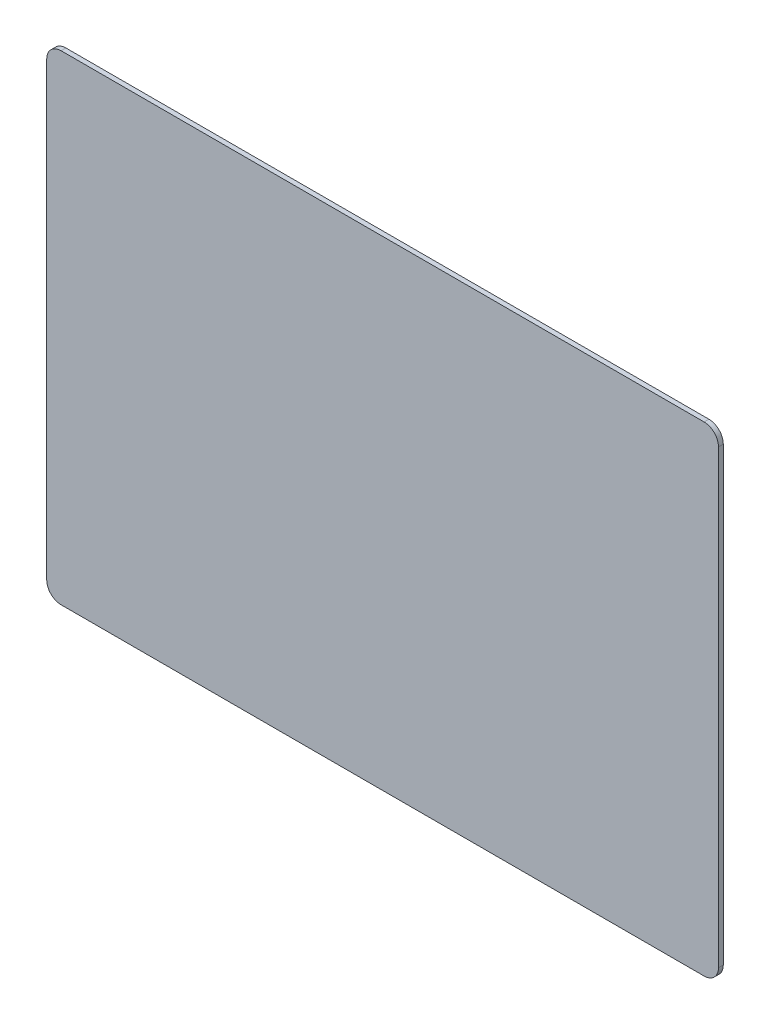
ISO-10303-21;
HEADER;
FILE_DESCRIPTION(('STEP AP214'),'2;1');
FILE_NAME('part.step','',(''),(''),'','','');
FILE_SCHEMA(('AUTOMOTIVE_DESIGN { 1 0 10303 214 1 1 1 1 }'));
ENDSEC;
DATA;
#1=APPLICATION_CONTEXT('core data for automotive mechanical design processes');
#2=APPLICATION_PROTOCOL_DEFINITION('international standard','automotive_design',2000,#1);
#3=PRODUCT_CONTEXT('',#1,'mechanical');
#4=PRODUCT('Part','Part','',(#3));
#5=PRODUCT_RELATED_PRODUCT_CATEGORY('part','',(#4));
#6=PRODUCT_DEFINITION_FORMATION('','',#4);
#7=PRODUCT_DEFINITION_CONTEXT('part definition',#1,'design');
#8=PRODUCT_DEFINITION('design','',#6,#7);
#9=PRODUCT_DEFINITION_SHAPE('','',#8);
#10=(LENGTH_UNIT() NAMED_UNIT(*) SI_UNIT(.MILLI.,.METRE.));
#11=(NAMED_UNIT(*) PLANE_ANGLE_UNIT() SI_UNIT($,.RADIAN.));
#12=(NAMED_UNIT(*) SI_UNIT($,.STERADIAN.) SOLID_ANGLE_UNIT());
#13=UNCERTAINTY_MEASURE_WITH_UNIT(LENGTH_MEASURE(1.E-05),#10,'distance_accuracy_value','');
#14=(GEOMETRIC_REPRESENTATION_CONTEXT(3) GLOBAL_UNCERTAINTY_ASSIGNED_CONTEXT((#13)) GLOBAL_UNIT_ASSIGNED_CONTEXT((#10,
#11,#12)) REPRESENTATION_CONTEXT('',''));
#15=CARTESIAN_POINT('',(0.,0.,0.));
#16=DIRECTION('',(0.,0.,1.));
#17=DIRECTION('',(1.,0.,0.));
#18=AXIS2_PLACEMENT_3D('',#15,#16,#17);
#19=CARTESIAN_POINT('',(70.,-50.,-1.));
#20=DIRECTION('',(1.,0.,0.));
#21=DIRECTION('',(0.,0.,-1.));
#22=AXIS2_PLACEMENT_3D('',#19,#20,#21);
#23=PLANE('',#22);
#24=DIRECTION('',(0.,1.,0.));
#25=VECTOR('',#24,1.);
#26=CARTESIAN_POINT('',(70.,-50.,0.));
#27=LINE('',#26,#25);
#28=CARTESIAN_POINT('',(70.,-47.,0.));
#29=VERTEX_POINT('',#28);
#30=CARTESIAN_POINT('',(70.,47.,0.));
#31=VERTEX_POINT('',#30);
#32=EDGE_CURVE('E106',#29,#31,#27,.T.);
#33=ORIENTED_EDGE('',*,*,#32,.F.);
#34=DIRECTION('',(0.,0.,1.));
#35=VECTOR('',#34,1.);
#36=CARTESIAN_POINT('',(70.,-47.,-1.));
#37=LINE('',#36,#35);
#38=CARTESIAN_POINT('',(70.,-47.,-1.));
#39=VERTEX_POINT('',#38);
#40=EDGE_CURVE('E11',#29,#39,#37,.F.);
#41=ORIENTED_EDGE('',*,*,#40,.T.);
#42=DIRECTION('',(0.,1.,0.));
#43=VECTOR('',#42,1.);
#44=CARTESIAN_POINT('',(70.,-50.,-1.));
#45=LINE('',#44,#43);
#46=CARTESIAN_POINT('',(70.,47.,-1.));
#47=VERTEX_POINT('',#46);
#48=EDGE_CURVE('E156',#39,#47,#45,.T.);
#49=ORIENTED_EDGE('',*,*,#48,.T.);
#50=DIRECTION('',(0.,0.,1.));
#51=VECTOR('',#50,1.);
#52=CARTESIAN_POINT('',(70.,47.,-1.));
#53=LINE('',#52,#51);
#54=EDGE_CURVE('E43',#47,#31,#53,.T.);
#55=ORIENTED_EDGE('',*,*,#54,.T.);
#56=EDGE_LOOP('',(#33,#41,#49,#55));
#57=FACE_BOUND('',#56,.T.);
#58=ADVANCED_FACE('F35',(#57),#23,.T.);
#59=CARTESIAN_POINT('',(-70.,-50.,-1.));
#60=DIRECTION('',(0.,-1.,0.));
#61=DIRECTION('',(0.,0.,-1.));
#62=AXIS2_PLACEMENT_3D('',#59,#60,#61);
#63=PLANE('',#62);
#64=DIRECTION('',(1.,0.,0.));
#65=VECTOR('',#64,1.);
#66=CARTESIAN_POINT('',(-70.,-50.,0.));
#67=LINE('',#66,#65);
#68=CARTESIAN_POINT('',(-67.,-50.,0.));
#69=VERTEX_POINT('',#68);
#70=CARTESIAN_POINT('',(67.,-50.,0.));
#71=VERTEX_POINT('',#70);
#72=EDGE_CURVE('E131',#69,#71,#67,.T.);
#73=ORIENTED_EDGE('',*,*,#72,.F.);
#74=DIRECTION('',(0.,0.,1.));
#75=VECTOR('',#74,1.);
#76=CARTESIAN_POINT('',(-67.,-50.,-1.));
#77=LINE('',#76,#75);
#78=CARTESIAN_POINT('',(-67.,-50.,-1.));
#79=VERTEX_POINT('',#78);
#80=EDGE_CURVE('E57',#69,#79,#77,.F.);
#81=ORIENTED_EDGE('',*,*,#80,.T.);
#82=DIRECTION('',(1.,0.,0.));
#83=VECTOR('',#82,1.);
#84=CARTESIAN_POINT('',(-70.,-50.,-1.));
#85=LINE('',#84,#83);
#86=CARTESIAN_POINT('',(67.,-50.,-1.));
#87=VERTEX_POINT('',#86);
#88=EDGE_CURVE('E125',#79,#87,#85,.T.);
#89=ORIENTED_EDGE('',*,*,#88,.T.);
#90=DIRECTION('',(0.,0.,1.));
#91=VECTOR('',#90,1.);
#92=CARTESIAN_POINT('',(67.,-50.,-1.));
#93=LINE('',#92,#91);
#94=EDGE_CURVE('E150',#87,#71,#93,.T.);
#95=ORIENTED_EDGE('',*,*,#94,.T.);
#96=EDGE_LOOP('',(#73,#81,#89,#95));
#97=FACE_BOUND('',#96,.T.);
#98=ADVANCED_FACE('F188',(#97),#63,.T.);
#99=CARTESIAN_POINT('',(-70.,-50.,-1.));
#100=DIRECTION('',(-1.,0.,0.));
#101=DIRECTION('',(0.,0.,1.));
#102=AXIS2_PLACEMENT_3D('',#99,#100,#101);
#103=PLANE('',#102);
#104=DIRECTION('',(0.,-1.,0.));
#105=VECTOR('',#104,1.);
#106=CARTESIAN_POINT('',(-70.,-50.,0.));
#107=LINE('',#106,#105);
#108=CARTESIAN_POINT('',(-70.,47.,0.));
#109=VERTEX_POINT('',#108);
#110=CARTESIAN_POINT('',(-70.,-47.,0.));
#111=VERTEX_POINT('',#110);
#112=EDGE_CURVE('E121',#109,#111,#107,.T.);
#113=ORIENTED_EDGE('',*,*,#112,.F.);
#114=DIRECTION('',(0.,0.,1.));
#115=VECTOR('',#114,1.);
#116=CARTESIAN_POINT('',(-70.,47.,-1.));
#117=LINE('',#116,#115);
#118=CARTESIAN_POINT('',(-70.,47.,-1.));
#119=VERTEX_POINT('',#118);
#120=EDGE_CURVE('E142',#109,#119,#117,.F.);
#121=ORIENTED_EDGE('',*,*,#120,.T.);
#122=DIRECTION('',(0.,-1.,0.));
#123=VECTOR('',#122,1.);
#124=CARTESIAN_POINT('',(-70.,-50.,-1.));
#125=LINE('',#124,#123);
#126=CARTESIAN_POINT('',(-70.,-47.,-1.));
#127=VERTEX_POINT('',#126);
#128=EDGE_CURVE('E128',#119,#127,#125,.T.);
#129=ORIENTED_EDGE('',*,*,#128,.T.);
#130=DIRECTION('',(0.,0.,1.));
#131=VECTOR('',#130,1.);
#132=CARTESIAN_POINT('',(-70.,-47.,-1.));
#133=LINE('',#132,#131);
#134=EDGE_CURVE('E139',#127,#111,#133,.T.);
#135=ORIENTED_EDGE('',*,*,#134,.T.);
#136=EDGE_LOOP('',(#113,#121,#129,#135));
#137=FACE_BOUND('',#136,.T.);
#138=ADVANCED_FACE('F168',(#137),#103,.T.);
#139=CARTESIAN_POINT('',(-70.,50.,-1.));
#140=DIRECTION('',(0.,1.,0.));
#141=DIRECTION('',(0.,0.,1.));
#142=AXIS2_PLACEMENT_3D('',#139,#140,#141);
#143=PLANE('',#142);
#144=DIRECTION('',(-1.,0.,0.));
#145=VECTOR('',#144,1.);
#146=CARTESIAN_POINT('',(-70.,50.,-1.));
#147=LINE('',#146,#145);
#148=CARTESIAN_POINT('',(67.,50.,-1.));
#149=VERTEX_POINT('',#148);
#150=CARTESIAN_POINT('',(-67.,50.,-1.));
#151=VERTEX_POINT('',#150);
#152=EDGE_CURVE('E157',#149,#151,#147,.T.);
#153=ORIENTED_EDGE('',*,*,#152,.T.);
#154=DIRECTION('',(0.,0.,1.));
#155=VECTOR('',#154,1.);
#156=CARTESIAN_POINT('',(-67.,50.,-1.));
#157=LINE('',#156,#155);
#158=CARTESIAN_POINT('',(-67.,50.,0.));
#159=VERTEX_POINT('',#158);
#160=EDGE_CURVE('E112',#151,#159,#157,.T.);
#161=ORIENTED_EDGE('',*,*,#160,.T.);
#162=DIRECTION('',(-1.,0.,0.));
#163=VECTOR('',#162,1.);
#164=CARTESIAN_POINT('',(-70.,50.,0.));
#165=LINE('',#164,#163);
#166=CARTESIAN_POINT('',(67.,50.,0.));
#167=VERTEX_POINT('',#166);
#168=EDGE_CURVE('E104',#167,#159,#165,.T.);
#169=ORIENTED_EDGE('',*,*,#168,.F.);
#170=DIRECTION('',(0.,0.,1.));
#171=VECTOR('',#170,1.);
#172=CARTESIAN_POINT('',(67.,50.,-1.));
#173=LINE('',#172,#171);
#174=EDGE_CURVE('E118',#167,#149,#173,.F.);
#175=ORIENTED_EDGE('',*,*,#174,.T.);
#176=EDGE_LOOP('',(#153,#161,#169,#175));
#177=FACE_BOUND('',#176,.T.);
#178=ADVANCED_FACE('F117',(#177),#143,.T.);
#179=CARTESIAN_POINT('',(0.,0.,-1.));
#180=DIRECTION('',(0.,0.,-1.));
#181=DIRECTION('',(-1.,0.,0.));
#182=AXIS2_PLACEMENT_3D('',#179,#180,#181);
#183=PLANE('',#182);
#184=ORIENTED_EDGE('',*,*,#128,.F.);
#185=CARTESIAN_POINT('',(-67.,47.,-1.));
#186=DIRECTION('',(0.,0.,-1.));
#187=DIRECTION('',(-1.,0.,0.));
#188=AXIS2_PLACEMENT_3D('',#185,#186,#187);
#189=CIRCLE('',#188,3.);
#190=EDGE_CURVE('E148',#119,#151,#189,.T.);
#191=ORIENTED_EDGE('',*,*,#190,.T.);
#192=ORIENTED_EDGE('',*,*,#152,.F.);
#193=CARTESIAN_POINT('',(67.,47.,-1.));
#194=DIRECTION('',(0.,0.,-1.));
#195=DIRECTION('',(-1.,0.,0.));
#196=AXIS2_PLACEMENT_3D('',#193,#194,#195);
#197=CIRCLE('',#196,3.);
#198=EDGE_CURVE('E124',#149,#47,#197,.T.);
#199=ORIENTED_EDGE('',*,*,#198,.T.);
#200=ORIENTED_EDGE('',*,*,#48,.F.);
#201=CARTESIAN_POINT('',(67.,-47.,-1.));
#202=DIRECTION('',(0.,0.,-1.));
#203=DIRECTION('',(-1.,0.,0.));
#204=AXIS2_PLACEMENT_3D('',#201,#202,#203);
#205=CIRCLE('',#204,3.);
#206=EDGE_CURVE('E50',#39,#87,#205,.T.);
#207=ORIENTED_EDGE('',*,*,#206,.T.);
#208=ORIENTED_EDGE('',*,*,#88,.F.);
#209=CARTESIAN_POINT('',(-67.,-47.,-1.));
#210=DIRECTION('',(0.,0.,-1.));
#211=DIRECTION('',(-1.,0.,0.));
#212=AXIS2_PLACEMENT_3D('',#209,#210,#211);
#213=CIRCLE('',#212,3.);
#214=EDGE_CURVE('E146',#79,#127,#213,.T.);
#215=ORIENTED_EDGE('',*,*,#214,.T.);
#216=EDGE_LOOP('',(#184,#191,#192,#199,#200,#207,#208,#215));
#217=FACE_BOUND('',#216,.T.);
#218=ADVANCED_FACE('F174',(#217),#183,.T.);
#219=CARTESIAN_POINT('',(0.,0.,0.));
#220=DIRECTION('',(0.,0.,-1.));
#221=DIRECTION('',(-1.,0.,0.));
#222=AXIS2_PLACEMENT_3D('',#219,#220,#221);
#223=PLANE('',#222);
#224=ORIENTED_EDGE('',*,*,#168,.T.);
#225=CARTESIAN_POINT('',(-67.,47.,0.));
#226=DIRECTION('',(0.,0.,-1.));
#227=DIRECTION('',(-1.,0.,0.));
#228=AXIS2_PLACEMENT_3D('',#225,#226,#227);
#229=CIRCLE('',#228,3.);
#230=EDGE_CURVE('E137',#159,#109,#229,.F.);
#231=ORIENTED_EDGE('',*,*,#230,.T.);
#232=ORIENTED_EDGE('',*,*,#112,.T.);
#233=CARTESIAN_POINT('',(-67.,-47.,0.));
#234=DIRECTION('',(0.,0.,-1.));
#235=DIRECTION('',(-1.,0.,0.));
#236=AXIS2_PLACEMENT_3D('',#233,#234,#235);
#237=CIRCLE('',#236,3.);
#238=EDGE_CURVE('E135',#111,#69,#237,.F.);
#239=ORIENTED_EDGE('',*,*,#238,.T.);
#240=ORIENTED_EDGE('',*,*,#72,.T.);
#241=CARTESIAN_POINT('',(67.,-47.,0.));
#242=DIRECTION('',(0.,0.,-1.));
#243=DIRECTION('',(-1.,0.,0.));
#244=AXIS2_PLACEMENT_3D('',#241,#242,#243);
#245=CIRCLE('',#244,3.);
#246=EDGE_CURVE('E111',#71,#29,#245,.F.);
#247=ORIENTED_EDGE('',*,*,#246,.T.);
#248=ORIENTED_EDGE('',*,*,#32,.T.);
#249=CARTESIAN_POINT('',(67.,47.,0.));
#250=DIRECTION('',(0.,0.,-1.));
#251=DIRECTION('',(-1.,0.,0.));
#252=AXIS2_PLACEMENT_3D('',#249,#250,#251);
#253=CIRCLE('',#252,3.);
#254=EDGE_CURVE('E101',#31,#167,#253,.F.);
#255=ORIENTED_EDGE('',*,*,#254,.T.);
#256=EDGE_LOOP('',(#224,#231,#232,#239,#240,#247,#248,#255));
#257=FACE_BOUND('',#256,.T.);
#258=ADVANCED_FACE('F103',(#257),#223,.F.);
#259=CARTESIAN_POINT('',(-67.,47.,-1.));
#260=DIRECTION('',(0.,0.,1.));
#261=DIRECTION('',(1.,0.,0.));
#262=AXIS2_PLACEMENT_3D('',#259,#260,#261);
#263=CYLINDRICAL_SURFACE('',#262,3.);
#264=ORIENTED_EDGE('',*,*,#190,.F.);
#265=ORIENTED_EDGE('',*,*,#120,.F.);
#266=ORIENTED_EDGE('',*,*,#230,.F.);
#267=ORIENTED_EDGE('',*,*,#160,.F.);
#268=EDGE_LOOP('',(#264,#265,#266,#267));
#269=FACE_BOUND('',#268,.T.);
#270=ADVANCED_FACE('F173',(#269),#263,.T.);
#271=CARTESIAN_POINT('',(-67.,-47.,-1.));
#272=DIRECTION('',(0.,0.,1.));
#273=DIRECTION('',(1.,0.,0.));
#274=AXIS2_PLACEMENT_3D('',#271,#272,#273);
#275=CYLINDRICAL_SURFACE('',#274,3.);
#276=ORIENTED_EDGE('',*,*,#214,.F.);
#277=ORIENTED_EDGE('',*,*,#80,.F.);
#278=ORIENTED_EDGE('',*,*,#238,.F.);
#279=ORIENTED_EDGE('',*,*,#134,.F.);
#280=EDGE_LOOP('',(#276,#277,#278,#279));
#281=FACE_BOUND('',#280,.T.);
#282=ADVANCED_FACE('F177',(#281),#275,.T.);
#283=CARTESIAN_POINT('',(67.,-47.,-1.));
#284=DIRECTION('',(0.,0.,1.));
#285=DIRECTION('',(1.,0.,0.));
#286=AXIS2_PLACEMENT_3D('',#283,#284,#285);
#287=CYLINDRICAL_SURFACE('',#286,3.);
#288=ORIENTED_EDGE('',*,*,#206,.F.);
#289=ORIENTED_EDGE('',*,*,#40,.F.);
#290=ORIENTED_EDGE('',*,*,#246,.F.);
#291=ORIENTED_EDGE('',*,*,#94,.F.);
#292=EDGE_LOOP('',(#288,#289,#290,#291));
#293=FACE_BOUND('',#292,.T.);
#294=ADVANCED_FACE('F179',(#293),#287,.T.);
#295=CARTESIAN_POINT('',(67.,47.,-1.));
#296=DIRECTION('',(0.,0.,1.));
#297=DIRECTION('',(1.,0.,0.));
#298=AXIS2_PLACEMENT_3D('',#295,#296,#297);
#299=CYLINDRICAL_SURFACE('',#298,3.);
#300=ORIENTED_EDGE('',*,*,#198,.F.);
#301=ORIENTED_EDGE('',*,*,#174,.F.);
#302=ORIENTED_EDGE('',*,*,#254,.F.);
#303=ORIENTED_EDGE('',*,*,#54,.F.);
#304=EDGE_LOOP('',(#300,#301,#302,#303));
#305=FACE_BOUND('',#304,.T.);
#306=ADVANCED_FACE('F37',(#305),#299,.T.);
#307=CLOSED_SHELL('',(#58,#98,#138,#178,#218,#258,#270,#282,#294,#306));
#308=MANIFOLD_SOLID_BREP('B2',#307);
#309=ADVANCED_BREP_SHAPE_REPRESENTATION('',(#18,#308),#14);
#310=SHAPE_DEFINITION_REPRESENTATION(#9,#309);
ENDSEC;
END-ISO-10303-21;
